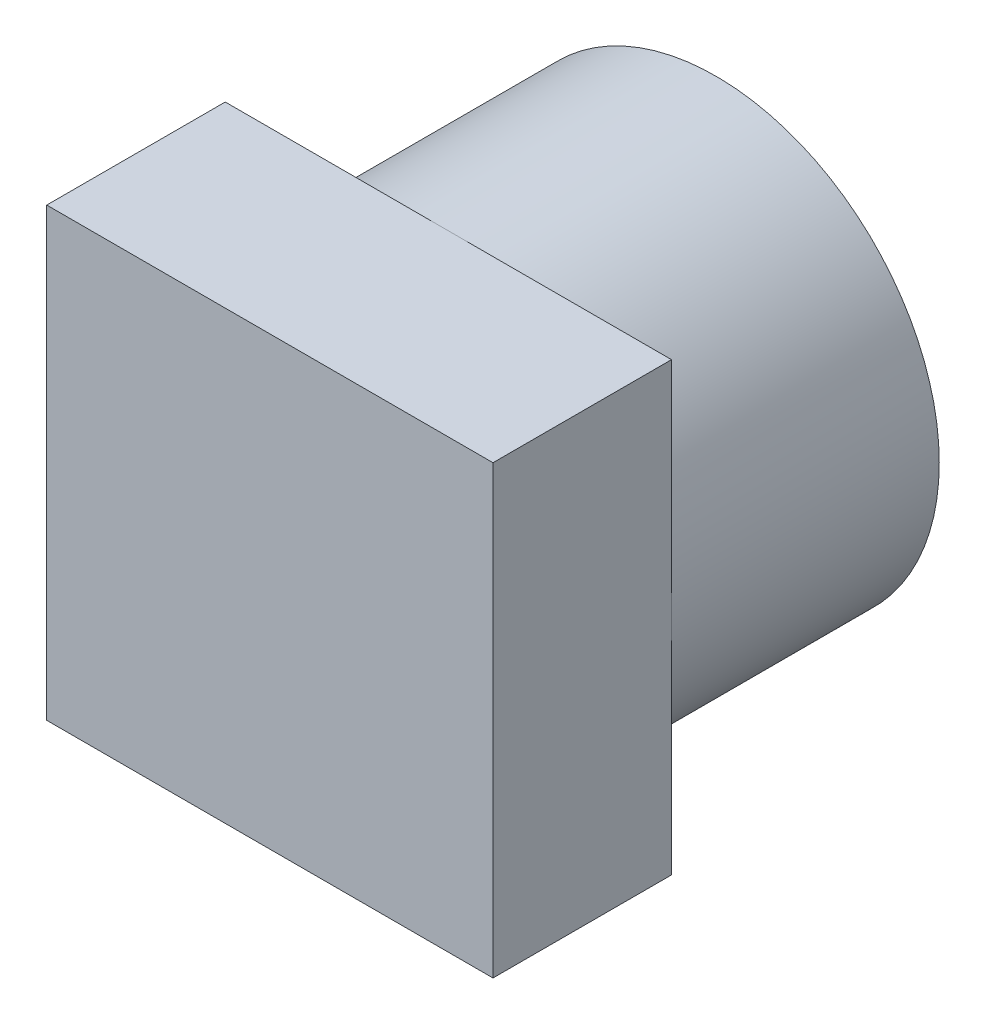
ISO-10303-21;
HEADER;
FILE_DESCRIPTION(('STEP AP214'),'2;1');
FILE_NAME('part.step','',(''),(''),'','','');
FILE_SCHEMA(('AUTOMOTIVE_DESIGN { 1 0 10303 214 1 1 1 1 }'));
ENDSEC;
DATA;
#1=APPLICATION_CONTEXT('core data for automotive mechanical design processes');
#2=APPLICATION_PROTOCOL_DEFINITION('international standard','automotive_design',2000,#1);
#3=PRODUCT_CONTEXT('',#1,'mechanical');
#4=PRODUCT('Part','Part','',(#3));
#5=PRODUCT_RELATED_PRODUCT_CATEGORY('part','',(#4));
#6=PRODUCT_DEFINITION_FORMATION('','',#4);
#7=PRODUCT_DEFINITION_CONTEXT('part definition',#1,'design');
#8=PRODUCT_DEFINITION('design','',#6,#7);
#9=PRODUCT_DEFINITION_SHAPE('','',#8);
#10=(LENGTH_UNIT() NAMED_UNIT(*) SI_UNIT(.MILLI.,.METRE.));
#11=(NAMED_UNIT(*) PLANE_ANGLE_UNIT() SI_UNIT($,.RADIAN.));
#12=(NAMED_UNIT(*) SI_UNIT($,.STERADIAN.) SOLID_ANGLE_UNIT());
#13=UNCERTAINTY_MEASURE_WITH_UNIT(LENGTH_MEASURE(1.E-05),#10,'distance_accuracy_value','');
#14=(GEOMETRIC_REPRESENTATION_CONTEXT(3) GLOBAL_UNCERTAINTY_ASSIGNED_CONTEXT((#13)) GLOBAL_UNIT_ASSIGNED_CONTEXT((#10,
#11,#12)) REPRESENTATION_CONTEXT('',''));
#15=CARTESIAN_POINT('',(0.,0.,0.));
#16=DIRECTION('',(0.,0.,1.));
#17=DIRECTION('',(1.,0.,0.));
#18=AXIS2_PLACEMENT_3D('',#15,#16,#17);
#19=CARTESIAN_POINT('',(0.,0.,1.5));
#20=DIRECTION('',(0.,0.,-1.));
#21=DIRECTION('',(-1.,0.,0.));
#22=AXIS2_PLACEMENT_3D('',#19,#20,#21);
#23=CYLINDRICAL_SURFACE('',#22,1.24999999999997);
#24=CARTESIAN_POINT('',(0.,0.,1.5));
#25=DIRECTION('',(0.,0.,1.));
#26=DIRECTION('',(1.,0.,0.));
#27=AXIS2_PLACEMENT_3D('',#24,#25,#26);
#28=CIRCLE('',#27,1.24999999999997);
#29=CARTESIAN_POINT('',(1.25,0.,1.5));
#30=VERTEX_POINT('',#29);
#31=CARTESIAN_POINT('',(0.,1.25,1.5));
#32=VERTEX_POINT('',#31);
#33=EDGE_CURVE('E11',#30,#32,#28,.T.);
#34=ORIENTED_EDGE('',*,*,#33,.F.);
#35=CARTESIAN_POINT('',(0.,-1.25,1.5));
#36=VERTEX_POINT('',#35);
#37=EDGE_CURVE('E43',#36,#30,#28,.T.);
#38=ORIENTED_EDGE('',*,*,#37,.F.);
#39=CARTESIAN_POINT('',(-1.25,0.,1.5));
#40=VERTEX_POINT('',#39);
#41=EDGE_CURVE('E53',#40,#36,#28,.T.);
#42=ORIENTED_EDGE('',*,*,#41,.F.);
#43=EDGE_CURVE('E42',#32,#40,#28,.T.);
#44=ORIENTED_EDGE('',*,*,#43,.F.);
#45=EDGE_LOOP('',(#34,#38,#42,#44));
#46=FACE_BOUND('',#45,.T.);
#47=CARTESIAN_POINT('',(0.,0.,0.));
#48=DIRECTION('',(0.,0.,1.));
#49=DIRECTION('',(1.,0.,0.));
#50=AXIS2_PLACEMENT_3D('',#47,#48,#49);
#51=CIRCLE('',#50,1.24999999999997);
#52=CARTESIAN_POINT('',(1.24999999999997,0.,0.));
#53=VERTEX_POINT('',#52);
#54=EDGE_CURVE('E37',#53,#53,#51,.T.);
#55=ORIENTED_EDGE('',*,*,#54,.T.);
#56=EDGE_LOOP('',(#55));
#57=FACE_BOUND('',#56,.T.);
#58=ADVANCED_FACE('F34',(#46,#57),#23,.T.);
#59=CARTESIAN_POINT('',(0.,0.,0.));
#60=DIRECTION('',(0.,0.,1.));
#61=DIRECTION('',(1.,0.,0.));
#62=AXIS2_PLACEMENT_3D('',#59,#60,#61);
#63=PLANE('',#62);
#64=CARTESIAN_POINT('',(0.,0.,0.));
#65=DIRECTION('',(0.,0.,1.));
#66=DIRECTION('',(1.,0.,0.));
#67=AXIS2_PLACEMENT_3D('',#64,#65,#66);
#68=CIRCLE('',#67,0.5);
#69=CARTESIAN_POINT('',(0.5,0.,0.));
#70=VERTEX_POINT('',#69);
#71=EDGE_CURVE('E112',#70,#70,#68,.T.);
#72=ORIENTED_EDGE('',*,*,#71,.T.);
#73=EDGE_LOOP('',(#72));
#74=FACE_BOUND('',#73,.T.);
#75=ORIENTED_EDGE('',*,*,#54,.F.);
#76=EDGE_LOOP('',(#75));
#77=FACE_BOUND('',#76,.T.);
#78=ADVANCED_FACE('F163',(#74,#77),#63,.F.);
#79=CARTESIAN_POINT('',(0.,0.,1.));
#80=DIRECTION('',(0.,0.,-1.));
#81=DIRECTION('',(-1.,0.,0.));
#82=AXIS2_PLACEMENT_3D('',#79,#80,#81);
#83=CYLINDRICAL_SURFACE('',#82,0.5);
#84=CARTESIAN_POINT('',(0.,0.,1.));
#85=DIRECTION('',(0.,0.,1.));
#86=DIRECTION('',(1.,0.,0.));
#87=AXIS2_PLACEMENT_3D('',#84,#85,#86);
#88=CIRCLE('',#87,0.5);
#89=CARTESIAN_POINT('',(0.5,0.,1.));
#90=VERTEX_POINT('',#89);
#91=EDGE_CURVE('E115',#90,#90,#88,.T.);
#92=ORIENTED_EDGE('',*,*,#91,.T.);
#93=EDGE_LOOP('',(#92));
#94=FACE_BOUND('',#93,.T.);
#95=ORIENTED_EDGE('',*,*,#71,.F.);
#96=EDGE_LOOP('',(#95));
#97=FACE_BOUND('',#96,.T.);
#98=ADVANCED_FACE('F167',(#94,#97),#83,.F.);
#99=CARTESIAN_POINT('',(0.,0.,1.));
#100=DIRECTION('',(0.,0.,1.));
#101=DIRECTION('',(1.,0.,0.));
#102=AXIS2_PLACEMENT_3D('',#99,#100,#101);
#103=PLANE('',#102);
#104=ORIENTED_EDGE('',*,*,#91,.F.);
#105=EDGE_LOOP('',(#104));
#106=FACE_BOUND('',#105,.T.);
#107=ADVANCED_FACE('F172',(#106),#103,.F.);
#108=CARTESIAN_POINT('',(0.,0.,1.5));
#109=DIRECTION('',(0.,0.,1.));
#110=DIRECTION('',(1.,0.,0.));
#111=AXIS2_PLACEMENT_3D('',#108,#109,#110);
#112=PLANE('',#111);
#113=DIRECTION('',(0.,1.,0.));
#114=VECTOR('',#113,1.);
#115=CARTESIAN_POINT('',(1.25,1.25,1.5));
#116=LINE('',#115,#114);
#117=CARTESIAN_POINT('',(1.25,1.25,1.5));
#118=VERTEX_POINT('',#117);
#119=EDGE_CURVE('E110',#30,#118,#116,.T.);
#120=ORIENTED_EDGE('',*,*,#119,.F.);
#121=ORIENTED_EDGE('',*,*,#33,.T.);
#122=DIRECTION('',(-1.,0.,0.));
#123=VECTOR('',#122,1.);
#124=CARTESIAN_POINT('',(-1.25,1.25,1.5));
#125=LINE('',#124,#123);
#126=EDGE_CURVE('E146',#118,#32,#125,.T.);
#127=ORIENTED_EDGE('',*,*,#126,.F.);
#128=EDGE_LOOP('',(#120,#121,#127));
#129=FACE_BOUND('',#128,.T.);
#130=ADVANCED_FACE('F161',(#129),#112,.F.);
#131=CARTESIAN_POINT('',(-1.25,1.25,1.5));
#132=VERTEX_POINT('',#131);
#133=EDGE_CURVE('E139',#32,#132,#125,.T.);
#134=ORIENTED_EDGE('',*,*,#133,.F.);
#135=ORIENTED_EDGE('',*,*,#43,.T.);
#136=DIRECTION('',(0.,-1.,0.));
#137=VECTOR('',#136,1.);
#138=CARTESIAN_POINT('',(-1.25,1.25,1.5));
#139=LINE('',#138,#137);
#140=EDGE_CURVE('E138',#132,#40,#139,.T.);
#141=ORIENTED_EDGE('',*,*,#140,.F.);
#142=EDGE_LOOP('',(#134,#135,#141));
#143=FACE_BOUND('',#142,.T.);
#144=ADVANCED_FACE('F136',(#143),#112,.F.);
#145=CARTESIAN_POINT('',(-1.25,-1.25,1.5));
#146=VERTEX_POINT('',#145);
#147=EDGE_CURVE('E140',#40,#146,#139,.T.);
#148=ORIENTED_EDGE('',*,*,#147,.F.);
#149=ORIENTED_EDGE('',*,*,#41,.T.);
#150=DIRECTION('',(1.,0.,0.));
#151=VECTOR('',#150,1.);
#152=CARTESIAN_POINT('',(-1.25,-1.25,1.5));
#153=LINE('',#152,#151);
#154=EDGE_CURVE('E105',#146,#36,#153,.T.);
#155=ORIENTED_EDGE('',*,*,#154,.F.);
#156=EDGE_LOOP('',(#148,#149,#155));
#157=FACE_BOUND('',#156,.T.);
#158=ADVANCED_FACE('F141',(#157),#112,.F.);
#159=CARTESIAN_POINT('',(1.25,-1.25,1.5));
#160=VERTEX_POINT('',#159);
#161=EDGE_CURVE('E149',#36,#160,#153,.T.);
#162=ORIENTED_EDGE('',*,*,#161,.F.);
#163=ORIENTED_EDGE('',*,*,#37,.T.);
#164=EDGE_CURVE('E159',#160,#30,#116,.T.);
#165=ORIENTED_EDGE('',*,*,#164,.F.);
#166=EDGE_LOOP('',(#162,#163,#165));
#167=FACE_BOUND('',#166,.T.);
#168=ADVANCED_FACE('F181',(#167),#112,.F.);
#169=CARTESIAN_POINT('',(1.25,1.25,2.5));
#170=DIRECTION('',(-1.,0.,0.));
#171=DIRECTION('',(0.,-1.,0.));
#172=AXIS2_PLACEMENT_3D('',#169,#170,#171);
#173=PLANE('',#172);
#174=ORIENTED_EDGE('',*,*,#164,.T.);
#175=ORIENTED_EDGE('',*,*,#119,.T.);
#176=DIRECTION('',(0.,0.,-1.));
#177=VECTOR('',#176,1.);
#178=CARTESIAN_POINT('',(1.25,1.25,2.5));
#179=LINE('',#178,#177);
#180=CARTESIAN_POINT('',(1.25,1.25,2.5));
#181=VERTEX_POINT('',#180);
#182=EDGE_CURVE('E90',#181,#118,#179,.T.);
#183=ORIENTED_EDGE('',*,*,#182,.F.);
#184=DIRECTION('',(0.,1.,0.));
#185=VECTOR('',#184,1.);
#186=CARTESIAN_POINT('',(1.25,1.25,2.5));
#187=LINE('',#186,#185);
#188=CARTESIAN_POINT('',(1.25,-1.25,2.5));
#189=VERTEX_POINT('',#188);
#190=EDGE_CURVE('E96',#189,#181,#187,.T.);
#191=ORIENTED_EDGE('',*,*,#190,.F.);
#192=DIRECTION('',(0.,0.,-1.));
#193=VECTOR('',#192,1.);
#194=CARTESIAN_POINT('',(1.25,-1.25,2.5));
#195=LINE('',#194,#193);
#196=EDGE_CURVE('E154',#189,#160,#195,.T.);
#197=ORIENTED_EDGE('',*,*,#196,.T.);
#198=EDGE_LOOP('',(#174,#175,#183,#191,#197));
#199=FACE_BOUND('',#198,.T.);
#200=ADVANCED_FACE('F108',(#199),#173,.F.);
#201=CARTESIAN_POINT('',(-1.25,1.25,2.5));
#202=DIRECTION('',(0.,-1.,0.));
#203=DIRECTION('',(0.,0.,-1.));
#204=AXIS2_PLACEMENT_3D('',#201,#202,#203);
#205=PLANE('',#204);
#206=ORIENTED_EDGE('',*,*,#126,.T.);
#207=ORIENTED_EDGE('',*,*,#133,.T.);
#208=DIRECTION('',(0.,0.,-1.));
#209=VECTOR('',#208,1.);
#210=CARTESIAN_POINT('',(-1.25,1.25,2.5));
#211=LINE('',#210,#209);
#212=CARTESIAN_POINT('',(-1.25,1.25,2.5));
#213=VERTEX_POINT('',#212);
#214=EDGE_CURVE('E92',#213,#132,#211,.T.);
#215=ORIENTED_EDGE('',*,*,#214,.F.);
#216=DIRECTION('',(-1.,0.,0.));
#217=VECTOR('',#216,1.);
#218=CARTESIAN_POINT('',(-1.25,1.25,2.5));
#219=LINE('',#218,#217);
#220=EDGE_CURVE('E85',#181,#213,#219,.T.);
#221=ORIENTED_EDGE('',*,*,#220,.F.);
#222=ORIENTED_EDGE('',*,*,#182,.T.);
#223=EDGE_LOOP('',(#206,#207,#215,#221,#222));
#224=FACE_BOUND('',#223,.T.);
#225=ADVANCED_FACE('F88',(#224),#205,.F.);
#226=CARTESIAN_POINT('',(-1.25,1.25,2.5));
#227=DIRECTION('',(1.,0.,0.));
#228=DIRECTION('',(0.,1.,0.));
#229=AXIS2_PLACEMENT_3D('',#226,#227,#228);
#230=PLANE('',#229);
#231=ORIENTED_EDGE('',*,*,#140,.T.);
#232=ORIENTED_EDGE('',*,*,#147,.T.);
#233=DIRECTION('',(0.,0.,-1.));
#234=VECTOR('',#233,1.);
#235=CARTESIAN_POINT('',(-1.25,-1.25,2.5));
#236=LINE('',#235,#234);
#237=CARTESIAN_POINT('',(-1.25,-1.25,2.5));
#238=VERTEX_POINT('',#237);
#239=EDGE_CURVE('E117',#238,#146,#236,.T.);
#240=ORIENTED_EDGE('',*,*,#239,.F.);
#241=DIRECTION('',(0.,-1.,0.));
#242=VECTOR('',#241,1.);
#243=CARTESIAN_POINT('',(-1.25,1.25,2.5));
#244=LINE('',#243,#242);
#245=EDGE_CURVE('E95',#213,#238,#244,.T.);
#246=ORIENTED_EDGE('',*,*,#245,.F.);
#247=ORIENTED_EDGE('',*,*,#214,.T.);
#248=EDGE_LOOP('',(#231,#232,#240,#246,#247));
#249=FACE_BOUND('',#248,.T.);
#250=ADVANCED_FACE('F148',(#249),#230,.F.);
#251=CARTESIAN_POINT('',(-1.25,-1.25,2.5));
#252=DIRECTION('',(0.,1.,0.));
#253=DIRECTION('',(0.,0.,1.));
#254=AXIS2_PLACEMENT_3D('',#251,#252,#253);
#255=PLANE('',#254);
#256=ORIENTED_EDGE('',*,*,#154,.T.);
#257=ORIENTED_EDGE('',*,*,#161,.T.);
#258=ORIENTED_EDGE('',*,*,#196,.F.);
#259=DIRECTION('',(1.,0.,0.));
#260=VECTOR('',#259,1.);
#261=CARTESIAN_POINT('',(-1.25,-1.25,2.5));
#262=LINE('',#261,#260);
#263=EDGE_CURVE('E101',#238,#189,#262,.T.);
#264=ORIENTED_EDGE('',*,*,#263,.F.);
#265=ORIENTED_EDGE('',*,*,#239,.T.);
#266=EDGE_LOOP('',(#256,#257,#258,#264,#265));
#267=FACE_BOUND('',#266,.T.);
#268=ADVANCED_FACE('F156',(#267),#255,.F.);
#269=CARTESIAN_POINT('',(0.,0.,2.5));
#270=DIRECTION('',(0.,0.,1.));
#271=DIRECTION('',(1.,0.,0.));
#272=AXIS2_PLACEMENT_3D('',#269,#270,#271);
#273=PLANE('',#272);
#274=ORIENTED_EDGE('',*,*,#190,.T.);
#275=ORIENTED_EDGE('',*,*,#220,.T.);
#276=ORIENTED_EDGE('',*,*,#245,.T.);
#277=ORIENTED_EDGE('',*,*,#263,.T.);
#278=EDGE_LOOP('',(#274,#275,#276,#277));
#279=FACE_BOUND('',#278,.T.);
#280=ADVANCED_FACE('F99',(#279),#273,.T.);
#281=CLOSED_SHELL('',(#58,#78,#98,#107,#130,#144,#158,#168,#200,#225,#250,#268,#280));
#282=MANIFOLD_SOLID_BREP('B2',#281);
#283=ADVANCED_BREP_SHAPE_REPRESENTATION('',(#18,#282),#14);
#284=SHAPE_DEFINITION_REPRESENTATION(#9,#283);
ENDSEC;
END-ISO-10303-21;
